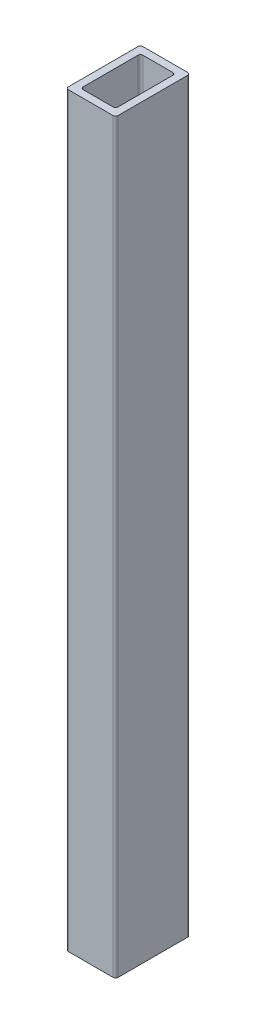
ISO-10303-21;
HEADER;
FILE_DESCRIPTION(('STEP AP214'),'2;1');
FILE_NAME('part.step','',(''),(''),'','','');
FILE_SCHEMA(('AUTOMOTIVE_DESIGN { 1 0 10303 214 1 1 1 1 }'));
ENDSEC;
DATA;
#1=APPLICATION_CONTEXT('core data for automotive mechanical design processes');
#2=APPLICATION_PROTOCOL_DEFINITION('international standard','automotive_design',2000,#1);
#3=PRODUCT_CONTEXT('',#1,'mechanical');
#4=PRODUCT('Part','Part','',(#3));
#5=PRODUCT_RELATED_PRODUCT_CATEGORY('part','',(#4));
#6=PRODUCT_DEFINITION_FORMATION('','',#4);
#7=PRODUCT_DEFINITION_CONTEXT('part definition',#1,'design');
#8=PRODUCT_DEFINITION('design','',#6,#7);
#9=PRODUCT_DEFINITION_SHAPE('','',#8);
#10=(LENGTH_UNIT() NAMED_UNIT(*) SI_UNIT(.MILLI.,.METRE.));
#11=(NAMED_UNIT(*) PLANE_ANGLE_UNIT() SI_UNIT($,.RADIAN.));
#12=(NAMED_UNIT(*) SI_UNIT($,.STERADIAN.) SOLID_ANGLE_UNIT());
#13=UNCERTAINTY_MEASURE_WITH_UNIT(LENGTH_MEASURE(1.E-05),#10,'distance_accuracy_value','');
#14=(GEOMETRIC_REPRESENTATION_CONTEXT(3) GLOBAL_UNCERTAINTY_ASSIGNED_CONTEXT((#13)) GLOBAL_UNIT_ASSIGNED_CONTEXT((#10,
#11,#12)) REPRESENTATION_CONTEXT('',''));
#15=CARTESIAN_POINT('',(0.,0.,0.));
#16=DIRECTION('',(0.,0.,1.));
#17=DIRECTION('',(1.,0.,0.));
#18=AXIS2_PLACEMENT_3D('',#15,#16,#17);
#19=CARTESIAN_POINT('',(-45.,1500.,70.));
#20=DIRECTION('',(0.,-1.,0.));
#21=DIRECTION('',(0.,0.,-1.));
#22=AXIS2_PLACEMENT_3D('',#19,#20,#21);
#23=PLANE('',#22);
#24=CARTESIAN_POINT('',(-45.,1500.,70.));
#25=DIRECTION('',(0.,1.,0.));
#26=DIRECTION('',(0.,0.,-1.));
#27=AXIS2_PLACEMENT_3D('',#24,#25,#26);
#28=CIRCLE('',#27,5.);
#29=CARTESIAN_POINT('',(-50.,1500.,70.));
#30=VERTEX_POINT('',#29);
#31=CARTESIAN_POINT('',(-45.,1500.,75.));
#32=VERTEX_POINT('',#31);
#33=EDGE_CURVE('E223',#30,#32,#28,.T.);
#34=ORIENTED_EDGE('',*,*,#33,.T.);
#35=DIRECTION('',(1.,0.,0.));
#36=VECTOR('',#35,1.);
#37=CARTESIAN_POINT('',(-45.,1500.,75.));
#38=LINE('',#37,#36);
#39=CARTESIAN_POINT('',(45.,1500.,75.));
#40=VERTEX_POINT('',#39);
#41=EDGE_CURVE('E226',#32,#40,#38,.T.);
#42=ORIENTED_EDGE('',*,*,#41,.T.);
#43=CARTESIAN_POINT('',(45.,1500.,70.));
#44=DIRECTION('',(0.,1.,0.));
#45=DIRECTION('',(0.,0.,1.));
#46=AXIS2_PLACEMENT_3D('',#43,#44,#45);
#47=CIRCLE('',#46,5.);
#48=CARTESIAN_POINT('',(50.,1500.,70.));
#49=VERTEX_POINT('',#48);
#50=EDGE_CURVE('E229',#40,#49,#47,.T.);
#51=ORIENTED_EDGE('',*,*,#50,.T.);
#52=DIRECTION('',(0.,0.,-1.));
#53=VECTOR('',#52,1.);
#54=CARTESIAN_POINT('',(50.,1500.,70.));
#55=LINE('',#54,#53);
#56=CARTESIAN_POINT('',(50.,1500.,-70.));
#57=VERTEX_POINT('',#56);
#58=EDGE_CURVE('E231',#49,#57,#55,.T.);
#59=ORIENTED_EDGE('',*,*,#58,.T.);
#60=CARTESIAN_POINT('',(45.,1500.,-70.));
#61=DIRECTION('',(0.,1.,0.));
#62=DIRECTION('',(0.,0.,1.));
#63=AXIS2_PLACEMENT_3D('',#60,#61,#62);
#64=CIRCLE('',#63,5.);
#65=CARTESIAN_POINT('',(45.,1500.,-75.));
#66=VERTEX_POINT('',#65);
#67=EDGE_CURVE('E233',#57,#66,#64,.T.);
#68=ORIENTED_EDGE('',*,*,#67,.T.);
#69=DIRECTION('',(-1.,0.,0.));
#70=VECTOR('',#69,1.);
#71=CARTESIAN_POINT('',(-45.,1500.,-75.));
#72=LINE('',#71,#70);
#73=CARTESIAN_POINT('',(-45.,1500.,-75.));
#74=VERTEX_POINT('',#73);
#75=EDGE_CURVE('E235',#66,#74,#72,.T.);
#76=ORIENTED_EDGE('',*,*,#75,.T.);
#77=CARTESIAN_POINT('',(-45.,1500.,-70.));
#78=DIRECTION('',(0.,1.,0.));
#79=DIRECTION('',(0.,0.,-1.));
#80=AXIS2_PLACEMENT_3D('',#77,#78,#79);
#81=CIRCLE('',#80,5.);
#82=CARTESIAN_POINT('',(-50.,1500.,-70.));
#83=VERTEX_POINT('',#82);
#84=EDGE_CURVE('E237',#74,#83,#81,.T.);
#85=ORIENTED_EDGE('',*,*,#84,.T.);
#86=DIRECTION('',(0.,0.,1.));
#87=VECTOR('',#86,1.);
#88=CARTESIAN_POINT('',(-50.,1500.,70.));
#89=LINE('',#88,#87);
#90=EDGE_CURVE('E239',#83,#30,#89,.T.);
#91=ORIENTED_EDGE('',*,*,#90,.T.);
#92=EDGE_LOOP('',(#34,#42,#51,#59,#68,#76,#85,#91));
#93=FACE_BOUND('',#92,.T.);
#94=CARTESIAN_POINT('',(-30.,1500.,55.));
#95=DIRECTION('',(0.,1.,0.));
#96=DIRECTION('',(0.,0.,1.));
#97=AXIS2_PLACEMENT_3D('',#94,#95,#96);
#98=CIRCLE('',#97,5.);
#99=CARTESIAN_POINT('',(-35.,1500.,55.));
#100=VERTEX_POINT('',#99);
#101=CARTESIAN_POINT('',(-30.,1500.,60.));
#102=VERTEX_POINT('',#101);
#103=EDGE_CURVE('E158',#100,#102,#98,.T.);
#104=ORIENTED_EDGE('',*,*,#103,.F.);
#105=DIRECTION('',(0.,0.,1.));
#106=VECTOR('',#105,1.);
#107=CARTESIAN_POINT('',(-35.,1500.,55.));
#108=LINE('',#107,#106);
#109=CARTESIAN_POINT('',(-35.,1500.,-55.));
#110=VERTEX_POINT('',#109);
#111=EDGE_CURVE('E191',#110,#100,#108,.T.);
#112=ORIENTED_EDGE('',*,*,#111,.F.);
#113=CARTESIAN_POINT('',(-30.,1500.,-55.));
#114=DIRECTION('',(0.,1.,0.));
#115=DIRECTION('',(0.,0.,1.));
#116=AXIS2_PLACEMENT_3D('',#113,#114,#115);
#117=CIRCLE('',#116,5.);
#118=CARTESIAN_POINT('',(-30.,1500.,-60.));
#119=VERTEX_POINT('',#118);
#120=EDGE_CURVE('E189',#119,#110,#117,.T.);
#121=ORIENTED_EDGE('',*,*,#120,.F.);
#122=DIRECTION('',(-1.,0.,0.));
#123=VECTOR('',#122,1.);
#124=CARTESIAN_POINT('',(-30.,1500.,-60.));
#125=LINE('',#124,#123);
#126=CARTESIAN_POINT('',(30.,1500.,-60.));
#127=VERTEX_POINT('',#126);
#128=EDGE_CURVE('E187',#127,#119,#125,.T.);
#129=ORIENTED_EDGE('',*,*,#128,.F.);
#130=CARTESIAN_POINT('',(30.,1500.,-55.));
#131=DIRECTION('',(0.,1.,0.));
#132=DIRECTION('',(0.,0.,1.));
#133=AXIS2_PLACEMENT_3D('',#130,#131,#132);
#134=CIRCLE('',#133,5.);
#135=CARTESIAN_POINT('',(35.,1500.,-55.));
#136=VERTEX_POINT('',#135);
#137=EDGE_CURVE('E185',#136,#127,#134,.T.);
#138=ORIENTED_EDGE('',*,*,#137,.F.);
#139=DIRECTION('',(0.,0.,-1.));
#140=VECTOR('',#139,1.);
#141=CARTESIAN_POINT('',(35.,1500.,55.));
#142=LINE('',#141,#140);
#143=CARTESIAN_POINT('',(35.,1500.,55.));
#144=VERTEX_POINT('',#143);
#145=EDGE_CURVE('E181',#144,#136,#142,.T.);
#146=ORIENTED_EDGE('',*,*,#145,.F.);
#147=CARTESIAN_POINT('',(30.,1500.,55.));
#148=DIRECTION('',(0.,1.,0.));
#149=DIRECTION('',(0.,0.,-1.));
#150=AXIS2_PLACEMENT_3D('',#147,#148,#149);
#151=CIRCLE('',#150,5.);
#152=CARTESIAN_POINT('',(30.,1500.,60.));
#153=VERTEX_POINT('',#152);
#154=EDGE_CURVE('E179',#153,#144,#151,.T.);
#155=ORIENTED_EDGE('',*,*,#154,.F.);
#156=DIRECTION('',(1.,0.,0.));
#157=VECTOR('',#156,1.);
#158=CARTESIAN_POINT('',(-30.,1500.,60.));
#159=LINE('',#158,#157);
#160=EDGE_CURVE('E166',#102,#153,#159,.T.);
#161=ORIENTED_EDGE('',*,*,#160,.F.);
#162=EDGE_LOOP('',(#104,#112,#121,#129,#138,#146,#155,#161));
#163=FACE_BOUND('',#162,.T.);
#164=ADVANCED_FACE('F45',(#93,#163),#23,.F.);
#165=CARTESIAN_POINT('',(-45.,0.,70.));
#166=DIRECTION('',(0.,-1.,0.));
#167=DIRECTION('',(0.,0.,-1.));
#168=AXIS2_PLACEMENT_3D('',#165,#166,#167);
#169=PLANE('',#168);
#170=CARTESIAN_POINT('',(-45.,0.,70.));
#171=DIRECTION('',(0.,1.,0.));
#172=DIRECTION('',(0.,0.,-1.));
#173=AXIS2_PLACEMENT_3D('',#170,#171,#172);
#174=CIRCLE('',#173,5.);
#175=CARTESIAN_POINT('',(-50.,0.,70.));
#176=VERTEX_POINT('',#175);
#177=CARTESIAN_POINT('',(-45.,0.,75.));
#178=VERTEX_POINT('',#177);
#179=EDGE_CURVE('E174',#176,#178,#174,.T.);
#180=ORIENTED_EDGE('',*,*,#179,.F.);
#181=DIRECTION('',(0.,0.,1.));
#182=VECTOR('',#181,1.);
#183=CARTESIAN_POINT('',(-50.,0.,70.));
#184=LINE('',#183,#182);
#185=CARTESIAN_POINT('',(-50.,0.,-70.));
#186=VERTEX_POINT('',#185);
#187=EDGE_CURVE('E227',#186,#176,#184,.T.);
#188=ORIENTED_EDGE('',*,*,#187,.F.);
#189=CARTESIAN_POINT('',(-45.,0.,-70.));
#190=DIRECTION('',(0.,1.,0.));
#191=DIRECTION('',(0.,0.,-1.));
#192=AXIS2_PLACEMENT_3D('',#189,#190,#191);
#193=CIRCLE('',#192,5.);
#194=CARTESIAN_POINT('',(-45.,0.,-75.));
#195=VERTEX_POINT('',#194);
#196=EDGE_CURVE('E254',#195,#186,#193,.T.);
#197=ORIENTED_EDGE('',*,*,#196,.F.);
#198=DIRECTION('',(-1.,0.,0.));
#199=VECTOR('',#198,1.);
#200=CARTESIAN_POINT('',(-45.,0.,-75.));
#201=LINE('',#200,#199);
#202=CARTESIAN_POINT('',(45.,0.,-75.));
#203=VERTEX_POINT('',#202);
#204=EDGE_CURVE('E252',#203,#195,#201,.T.);
#205=ORIENTED_EDGE('',*,*,#204,.F.);
#206=CARTESIAN_POINT('',(45.,0.,-70.));
#207=DIRECTION('',(0.,1.,0.));
#208=DIRECTION('',(0.,0.,1.));
#209=AXIS2_PLACEMENT_3D('',#206,#207,#208);
#210=CIRCLE('',#209,5.);
#211=CARTESIAN_POINT('',(50.,0.,-70.));
#212=VERTEX_POINT('',#211);
#213=EDGE_CURVE('E250',#212,#203,#210,.T.);
#214=ORIENTED_EDGE('',*,*,#213,.F.);
#215=DIRECTION('',(0.,0.,-1.));
#216=VECTOR('',#215,1.);
#217=CARTESIAN_POINT('',(50.,0.,70.));
#218=LINE('',#217,#216);
#219=CARTESIAN_POINT('',(50.,0.,70.));
#220=VERTEX_POINT('',#219);
#221=EDGE_CURVE('E248',#220,#212,#218,.T.);
#222=ORIENTED_EDGE('',*,*,#221,.F.);
#223=CARTESIAN_POINT('',(45.,0.,70.));
#224=DIRECTION('',(0.,1.,0.));
#225=DIRECTION('',(0.,0.,1.));
#226=AXIS2_PLACEMENT_3D('',#223,#224,#225);
#227=CIRCLE('',#226,5.);
#228=CARTESIAN_POINT('',(45.,0.,75.));
#229=VERTEX_POINT('',#228);
#230=EDGE_CURVE('E246',#229,#220,#227,.T.);
#231=ORIENTED_EDGE('',*,*,#230,.F.);
#232=DIRECTION('',(1.,0.,0.));
#233=VECTOR('',#232,1.);
#234=CARTESIAN_POINT('',(-45.,0.,75.));
#235=LINE('',#234,#233);
#236=EDGE_CURVE('E244',#178,#229,#235,.T.);
#237=ORIENTED_EDGE('',*,*,#236,.F.);
#238=EDGE_LOOP('',(#180,#188,#197,#205,#214,#222,#231,#237));
#239=FACE_BOUND('',#238,.T.);
#240=DIRECTION('',(0.,0.,1.));
#241=VECTOR('',#240,1.);
#242=CARTESIAN_POINT('',(-35.,0.,55.));
#243=LINE('',#242,#241);
#244=CARTESIAN_POINT('',(-35.,0.,-55.));
#245=VERTEX_POINT('',#244);
#246=CARTESIAN_POINT('',(-35.,0.,55.));
#247=VERTEX_POINT('',#246);
#248=EDGE_CURVE('E167',#245,#247,#243,.T.);
#249=ORIENTED_EDGE('',*,*,#248,.T.);
#250=CARTESIAN_POINT('',(-30.,0.,55.));
#251=DIRECTION('',(0.,1.,0.));
#252=DIRECTION('',(0.,0.,1.));
#253=AXIS2_PLACEMENT_3D('',#250,#251,#252);
#254=CIRCLE('',#253,5.);
#255=CARTESIAN_POINT('',(-30.,0.,60.));
#256=VERTEX_POINT('',#255);
#257=EDGE_CURVE('E68',#247,#256,#254,.T.);
#258=ORIENTED_EDGE('',*,*,#257,.T.);
#259=DIRECTION('',(1.,0.,0.));
#260=VECTOR('',#259,1.);
#261=CARTESIAN_POINT('',(-30.,0.,60.));
#262=LINE('',#261,#260);
#263=CARTESIAN_POINT('',(30.,0.,60.));
#264=VERTEX_POINT('',#263);
#265=EDGE_CURVE('E173',#256,#264,#262,.T.);
#266=ORIENTED_EDGE('',*,*,#265,.T.);
#267=CARTESIAN_POINT('',(30.,0.,55.));
#268=DIRECTION('',(0.,1.,0.));
#269=DIRECTION('',(0.,0.,-1.));
#270=AXIS2_PLACEMENT_3D('',#267,#268,#269);
#271=CIRCLE('',#270,5.);
#272=CARTESIAN_POINT('',(35.,0.,55.));
#273=VERTEX_POINT('',#272);
#274=EDGE_CURVE('E195',#264,#273,#271,.T.);
#275=ORIENTED_EDGE('',*,*,#274,.T.);
#276=DIRECTION('',(0.,0.,-1.));
#277=VECTOR('',#276,1.);
#278=CARTESIAN_POINT('',(35.,0.,55.));
#279=LINE('',#278,#277);
#280=CARTESIAN_POINT('',(35.,0.,-55.));
#281=VERTEX_POINT('',#280);
#282=EDGE_CURVE('E198',#273,#281,#279,.T.);
#283=ORIENTED_EDGE('',*,*,#282,.T.);
#284=CARTESIAN_POINT('',(30.,0.,-55.));
#285=DIRECTION('',(0.,1.,0.));
#286=DIRECTION('',(0.,0.,1.));
#287=AXIS2_PLACEMENT_3D('',#284,#285,#286);
#288=CIRCLE('',#287,5.);
#289=CARTESIAN_POINT('',(30.,0.,-60.));
#290=VERTEX_POINT('',#289);
#291=EDGE_CURVE('E201',#281,#290,#288,.T.);
#292=ORIENTED_EDGE('',*,*,#291,.T.);
#293=DIRECTION('',(-1.,0.,0.));
#294=VECTOR('',#293,1.);
#295=CARTESIAN_POINT('',(-30.,0.,-60.));
#296=LINE('',#295,#294);
#297=CARTESIAN_POINT('',(-30.,0.,-60.));
#298=VERTEX_POINT('',#297);
#299=EDGE_CURVE('E204',#290,#298,#296,.T.);
#300=ORIENTED_EDGE('',*,*,#299,.T.);
#301=CARTESIAN_POINT('',(-30.,0.,-55.));
#302=DIRECTION('',(0.,1.,0.));
#303=DIRECTION('',(0.,0.,1.));
#304=AXIS2_PLACEMENT_3D('',#301,#302,#303);
#305=CIRCLE('',#304,5.);
#306=EDGE_CURVE('E207',#298,#245,#305,.T.);
#307=ORIENTED_EDGE('',*,*,#306,.T.);
#308=EDGE_LOOP('',(#249,#258,#266,#275,#283,#292,#300,#307));
#309=FACE_BOUND('',#308,.T.);
#310=ADVANCED_FACE('F284',(#239,#309),#169,.T.);
#311=CARTESIAN_POINT('',(-45.,1500.,70.));
#312=DIRECTION('',(0.,-1.,0.));
#313=DIRECTION('',(0.,0.,-1.));
#314=AXIS2_PLACEMENT_3D('',#311,#312,#313);
#315=CYLINDRICAL_SURFACE('',#314,5.);
#316=ORIENTED_EDGE('',*,*,#179,.T.);
#317=DIRECTION('',(0.,-1.,0.));
#318=VECTOR('',#317,1.);
#319=CARTESIAN_POINT('',(-45.,1500.,75.));
#320=LINE('',#319,#318);
#321=EDGE_CURVE('E11',#32,#178,#320,.T.);
#322=ORIENTED_EDGE('',*,*,#321,.F.);
#323=ORIENTED_EDGE('',*,*,#33,.F.);
#324=DIRECTION('',(0.,-1.,0.));
#325=VECTOR('',#324,1.);
#326=CARTESIAN_POINT('',(-50.,1500.,70.));
#327=LINE('',#326,#325);
#328=EDGE_CURVE('E241',#30,#176,#327,.T.);
#329=ORIENTED_EDGE('',*,*,#328,.T.);
#330=EDGE_LOOP('',(#316,#322,#323,#329));
#331=FACE_BOUND('',#330,.T.);
#332=ADVANCED_FACE('F47',(#331),#315,.T.);
#333=CARTESIAN_POINT('',(-45.,1500.,75.));
#334=DIRECTION('',(0.,0.,-1.));
#335=DIRECTION('',(-1.,0.,0.));
#336=AXIS2_PLACEMENT_3D('',#333,#334,#335);
#337=PLANE('',#336);
#338=ORIENTED_EDGE('',*,*,#236,.T.);
#339=DIRECTION('',(0.,-1.,0.));
#340=VECTOR('',#339,1.);
#341=CARTESIAN_POINT('',(45.,1500.,75.));
#342=LINE('',#341,#340);
#343=EDGE_CURVE('E53',#40,#229,#342,.T.);
#344=ORIENTED_EDGE('',*,*,#343,.F.);
#345=ORIENTED_EDGE('',*,*,#41,.F.);
#346=ORIENTED_EDGE('',*,*,#321,.T.);
#347=EDGE_LOOP('',(#338,#344,#345,#346));
#348=FACE_BOUND('',#347,.T.);
#349=ADVANCED_FACE('F301',(#348),#337,.F.);
#350=CARTESIAN_POINT('',(45.,1500.,70.));
#351=DIRECTION('',(0.,-1.,0.));
#352=DIRECTION('',(0.,0.,-1.));
#353=AXIS2_PLACEMENT_3D('',#350,#351,#352);
#354=CYLINDRICAL_SURFACE('',#353,5.);
#355=ORIENTED_EDGE('',*,*,#230,.T.);
#356=DIRECTION('',(0.,-1.,0.));
#357=VECTOR('',#356,1.);
#358=CARTESIAN_POINT('',(50.,1500.,70.));
#359=LINE('',#358,#357);
#360=EDGE_CURVE('E271',#49,#220,#359,.T.);
#361=ORIENTED_EDGE('',*,*,#360,.F.);
#362=ORIENTED_EDGE('',*,*,#50,.F.);
#363=ORIENTED_EDGE('',*,*,#343,.T.);
#364=EDGE_LOOP('',(#355,#361,#362,#363));
#365=FACE_BOUND('',#364,.T.);
#366=ADVANCED_FACE('F278',(#365),#354,.T.);
#367=CARTESIAN_POINT('',(50.,1500.,70.));
#368=DIRECTION('',(-1.,0.,0.));
#369=DIRECTION('',(0.,0.,1.));
#370=AXIS2_PLACEMENT_3D('',#367,#368,#369);
#371=PLANE('',#370);
#372=ORIENTED_EDGE('',*,*,#221,.T.);
#373=DIRECTION('',(0.,-1.,0.));
#374=VECTOR('',#373,1.);
#375=CARTESIAN_POINT('',(50.,1500.,-70.));
#376=LINE('',#375,#374);
#377=EDGE_CURVE('E268',#57,#212,#376,.T.);
#378=ORIENTED_EDGE('',*,*,#377,.F.);
#379=ORIENTED_EDGE('',*,*,#58,.F.);
#380=ORIENTED_EDGE('',*,*,#360,.T.);
#381=EDGE_LOOP('',(#372,#378,#379,#380));
#382=FACE_BOUND('',#381,.T.);
#383=ADVANCED_FACE('F290',(#382),#371,.F.);
#384=CARTESIAN_POINT('',(45.,1500.,-70.));
#385=DIRECTION('',(0.,-1.,0.));
#386=DIRECTION('',(0.,0.,-1.));
#387=AXIS2_PLACEMENT_3D('',#384,#385,#386);
#388=CYLINDRICAL_SURFACE('',#387,5.);
#389=ORIENTED_EDGE('',*,*,#213,.T.);
#390=DIRECTION('',(0.,-1.,0.));
#391=VECTOR('',#390,1.);
#392=CARTESIAN_POINT('',(45.,1500.,-75.));
#393=LINE('',#392,#391);
#394=EDGE_CURVE('E265',#66,#203,#393,.T.);
#395=ORIENTED_EDGE('',*,*,#394,.F.);
#396=ORIENTED_EDGE('',*,*,#67,.F.);
#397=ORIENTED_EDGE('',*,*,#377,.T.);
#398=EDGE_LOOP('',(#389,#395,#396,#397));
#399=FACE_BOUND('',#398,.T.);
#400=ADVANCED_FACE('F294',(#399),#388,.T.);
#401=CARTESIAN_POINT('',(-45.,1500.,-75.));
#402=DIRECTION('',(0.,0.,1.));
#403=DIRECTION('',(1.,0.,0.));
#404=AXIS2_PLACEMENT_3D('',#401,#402,#403);
#405=PLANE('',#404);
#406=ORIENTED_EDGE('',*,*,#204,.T.);
#407=DIRECTION('',(0.,-1.,0.));
#408=VECTOR('',#407,1.);
#409=CARTESIAN_POINT('',(-45.,1500.,-75.));
#410=LINE('',#409,#408);
#411=EDGE_CURVE('E262',#74,#195,#410,.T.);
#412=ORIENTED_EDGE('',*,*,#411,.F.);
#413=ORIENTED_EDGE('',*,*,#75,.F.);
#414=ORIENTED_EDGE('',*,*,#394,.T.);
#415=EDGE_LOOP('',(#406,#412,#413,#414));
#416=FACE_BOUND('',#415,.T.);
#417=ADVANCED_FACE('F314',(#416),#405,.F.);
#418=CARTESIAN_POINT('',(-45.,1500.,-70.));
#419=DIRECTION('',(0.,-1.,0.));
#420=DIRECTION('',(0.,0.,-1.));
#421=AXIS2_PLACEMENT_3D('',#418,#419,#420);
#422=CYLINDRICAL_SURFACE('',#421,5.);
#423=ORIENTED_EDGE('',*,*,#196,.T.);
#424=DIRECTION('',(0.,-1.,0.));
#425=VECTOR('',#424,1.);
#426=CARTESIAN_POINT('',(-50.,1500.,-70.));
#427=LINE('',#426,#425);
#428=EDGE_CURVE('E259',#83,#186,#427,.T.);
#429=ORIENTED_EDGE('',*,*,#428,.F.);
#430=ORIENTED_EDGE('',*,*,#84,.F.);
#431=ORIENTED_EDGE('',*,*,#411,.T.);
#432=EDGE_LOOP('',(#423,#429,#430,#431));
#433=FACE_BOUND('',#432,.T.);
#434=ADVANCED_FACE('F312',(#433),#422,.T.);
#435=CARTESIAN_POINT('',(-50.,1500.,70.));
#436=DIRECTION('',(1.,0.,0.));
#437=DIRECTION('',(0.,0.,-1.));
#438=AXIS2_PLACEMENT_3D('',#435,#436,#437);
#439=PLANE('',#438);
#440=ORIENTED_EDGE('',*,*,#187,.T.);
#441=ORIENTED_EDGE('',*,*,#328,.F.);
#442=ORIENTED_EDGE('',*,*,#90,.F.);
#443=ORIENTED_EDGE('',*,*,#428,.T.);
#444=EDGE_LOOP('',(#440,#441,#442,#443));
#445=FACE_BOUND('',#444,.T.);
#446=ADVANCED_FACE('F307',(#445),#439,.F.);
#447=CARTESIAN_POINT('',(-30.,1500.,55.));
#448=DIRECTION('',(0.,-1.,0.));
#449=DIRECTION('',(0.,0.,-1.));
#450=AXIS2_PLACEMENT_3D('',#447,#448,#449);
#451=CYLINDRICAL_SURFACE('',#450,5.);
#452=ORIENTED_EDGE('',*,*,#257,.F.);
#453=DIRECTION('',(0.,-1.,0.));
#454=VECTOR('',#453,1.);
#455=CARTESIAN_POINT('',(-35.,1500.,55.));
#456=LINE('',#455,#454);
#457=EDGE_CURVE('E162',#100,#247,#456,.T.);
#458=ORIENTED_EDGE('',*,*,#457,.F.);
#459=ORIENTED_EDGE('',*,*,#103,.T.);
#460=DIRECTION('',(0.,-1.,0.));
#461=VECTOR('',#460,1.);
#462=CARTESIAN_POINT('',(-30.,1500.,60.));
#463=LINE('',#462,#461);
#464=EDGE_CURVE('E161',#102,#256,#463,.T.);
#465=ORIENTED_EDGE('',*,*,#464,.T.);
#466=EDGE_LOOP('',(#452,#458,#459,#465));
#467=FACE_BOUND('',#466,.T.);
#468=ADVANCED_FACE('F160',(#467),#451,.F.);
#469=CARTESIAN_POINT('',(-30.,1500.,60.));
#470=DIRECTION('',(0.,0.,-1.));
#471=DIRECTION('',(-1.,0.,0.));
#472=AXIS2_PLACEMENT_3D('',#469,#470,#471);
#473=PLANE('',#472);
#474=ORIENTED_EDGE('',*,*,#265,.F.);
#475=ORIENTED_EDGE('',*,*,#464,.F.);
#476=ORIENTED_EDGE('',*,*,#160,.T.);
#477=DIRECTION('',(0.,-1.,0.));
#478=VECTOR('',#477,1.);
#479=CARTESIAN_POINT('',(30.,1500.,60.));
#480=LINE('',#479,#478);
#481=EDGE_CURVE('E175',#153,#264,#480,.T.);
#482=ORIENTED_EDGE('',*,*,#481,.T.);
#483=EDGE_LOOP('',(#474,#475,#476,#482));
#484=FACE_BOUND('',#483,.T.);
#485=ADVANCED_FACE('F170',(#484),#473,.T.);
#486=CARTESIAN_POINT('',(30.,1500.,55.));
#487=DIRECTION('',(0.,-1.,0.));
#488=DIRECTION('',(0.,0.,-1.));
#489=AXIS2_PLACEMENT_3D('',#486,#487,#488);
#490=CYLINDRICAL_SURFACE('',#489,5.);
#491=ORIENTED_EDGE('',*,*,#274,.F.);
#492=ORIENTED_EDGE('',*,*,#481,.F.);
#493=ORIENTED_EDGE('',*,*,#154,.T.);
#494=DIRECTION('',(0.,-1.,0.));
#495=VECTOR('',#494,1.);
#496=CARTESIAN_POINT('',(35.,1500.,55.));
#497=LINE('',#496,#495);
#498=EDGE_CURVE('E220',#144,#273,#497,.T.);
#499=ORIENTED_EDGE('',*,*,#498,.T.);
#500=EDGE_LOOP('',(#491,#492,#493,#499));
#501=FACE_BOUND('',#500,.T.);
#502=ADVANCED_FACE('F338',(#501),#490,.F.);
#503=CARTESIAN_POINT('',(35.,1500.,55.));
#504=DIRECTION('',(-1.,0.,0.));
#505=DIRECTION('',(0.,0.,1.));
#506=AXIS2_PLACEMENT_3D('',#503,#504,#505);
#507=PLANE('',#506);
#508=ORIENTED_EDGE('',*,*,#282,.F.);
#509=ORIENTED_EDGE('',*,*,#498,.F.);
#510=ORIENTED_EDGE('',*,*,#145,.T.);
#511=DIRECTION('',(0.,-1.,0.));
#512=VECTOR('',#511,1.);
#513=CARTESIAN_POINT('',(35.,1500.,-55.));
#514=LINE('',#513,#512);
#515=EDGE_CURVE('E218',#136,#281,#514,.T.);
#516=ORIENTED_EDGE('',*,*,#515,.T.);
#517=EDGE_LOOP('',(#508,#509,#510,#516));
#518=FACE_BOUND('',#517,.T.);
#519=ADVANCED_FACE('F342',(#518),#507,.T.);
#520=CARTESIAN_POINT('',(30.,1500.,-55.));
#521=DIRECTION('',(0.,-1.,0.));
#522=DIRECTION('',(0.,0.,-1.));
#523=AXIS2_PLACEMENT_3D('',#520,#521,#522);
#524=CYLINDRICAL_SURFACE('',#523,5.);
#525=ORIENTED_EDGE('',*,*,#291,.F.);
#526=ORIENTED_EDGE('',*,*,#515,.F.);
#527=ORIENTED_EDGE('',*,*,#137,.T.);
#528=DIRECTION('',(0.,-1.,0.));
#529=VECTOR('',#528,1.);
#530=CARTESIAN_POINT('',(30.,1500.,-60.));
#531=LINE('',#530,#529);
#532=EDGE_CURVE('E216',#127,#290,#531,.T.);
#533=ORIENTED_EDGE('',*,*,#532,.T.);
#534=EDGE_LOOP('',(#525,#526,#527,#533));
#535=FACE_BOUND('',#534,.T.);
#536=ADVANCED_FACE('F348',(#535),#524,.F.);
#537=CARTESIAN_POINT('',(-30.,1500.,-60.));
#538=DIRECTION('',(0.,0.,1.));
#539=DIRECTION('',(1.,0.,0.));
#540=AXIS2_PLACEMENT_3D('',#537,#538,#539);
#541=PLANE('',#540);
#542=ORIENTED_EDGE('',*,*,#299,.F.);
#543=ORIENTED_EDGE('',*,*,#532,.F.);
#544=ORIENTED_EDGE('',*,*,#128,.T.);
#545=DIRECTION('',(0.,-1.,0.));
#546=VECTOR('',#545,1.);
#547=CARTESIAN_POINT('',(-30.,1500.,-60.));
#548=LINE('',#547,#546);
#549=EDGE_CURVE('E214',#119,#298,#548,.T.);
#550=ORIENTED_EDGE('',*,*,#549,.T.);
#551=EDGE_LOOP('',(#542,#543,#544,#550));
#552=FACE_BOUND('',#551,.T.);
#553=ADVANCED_FACE('F352',(#552),#541,.T.);
#554=CARTESIAN_POINT('',(-30.,1500.,-55.));
#555=DIRECTION('',(0.,-1.,0.));
#556=DIRECTION('',(0.,0.,-1.));
#557=AXIS2_PLACEMENT_3D('',#554,#555,#556);
#558=CYLINDRICAL_SURFACE('',#557,5.);
#559=ORIENTED_EDGE('',*,*,#306,.F.);
#560=ORIENTED_EDGE('',*,*,#549,.F.);
#561=ORIENTED_EDGE('',*,*,#120,.T.);
#562=DIRECTION('',(0.,-1.,0.));
#563=VECTOR('',#562,1.);
#564=CARTESIAN_POINT('',(-35.,1500.,-55.));
#565=LINE('',#564,#563);
#566=EDGE_CURVE('E60',#110,#245,#565,.T.);
#567=ORIENTED_EDGE('',*,*,#566,.T.);
#568=EDGE_LOOP('',(#559,#560,#561,#567));
#569=FACE_BOUND('',#568,.T.);
#570=ADVANCED_FACE('F356',(#569),#558,.F.);
#571=CARTESIAN_POINT('',(-35.,1500.,55.));
#572=DIRECTION('',(1.,0.,0.));
#573=DIRECTION('',(0.,0.,-1.));
#574=AXIS2_PLACEMENT_3D('',#571,#572,#573);
#575=PLANE('',#574);
#576=ORIENTED_EDGE('',*,*,#248,.F.);
#577=ORIENTED_EDGE('',*,*,#566,.F.);
#578=ORIENTED_EDGE('',*,*,#111,.T.);
#579=ORIENTED_EDGE('',*,*,#457,.T.);
#580=EDGE_LOOP('',(#576,#577,#578,#579));
#581=FACE_BOUND('',#580,.T.);
#582=ADVANCED_FACE('F360',(#581),#575,.T.);
#583=CLOSED_SHELL('',(#164,#310,#332,#349,#366,#383,#400,#417,#434,#446,#468,#485,#502,#519,
#536,#553,#570,#582));
#584=MANIFOLD_SOLID_BREP('B2',#583);
#585=ADVANCED_BREP_SHAPE_REPRESENTATION('',(#18,#584),#14);
#586=SHAPE_DEFINITION_REPRESENTATION(#9,#585);
ENDSEC;
END-ISO-10303-21;
